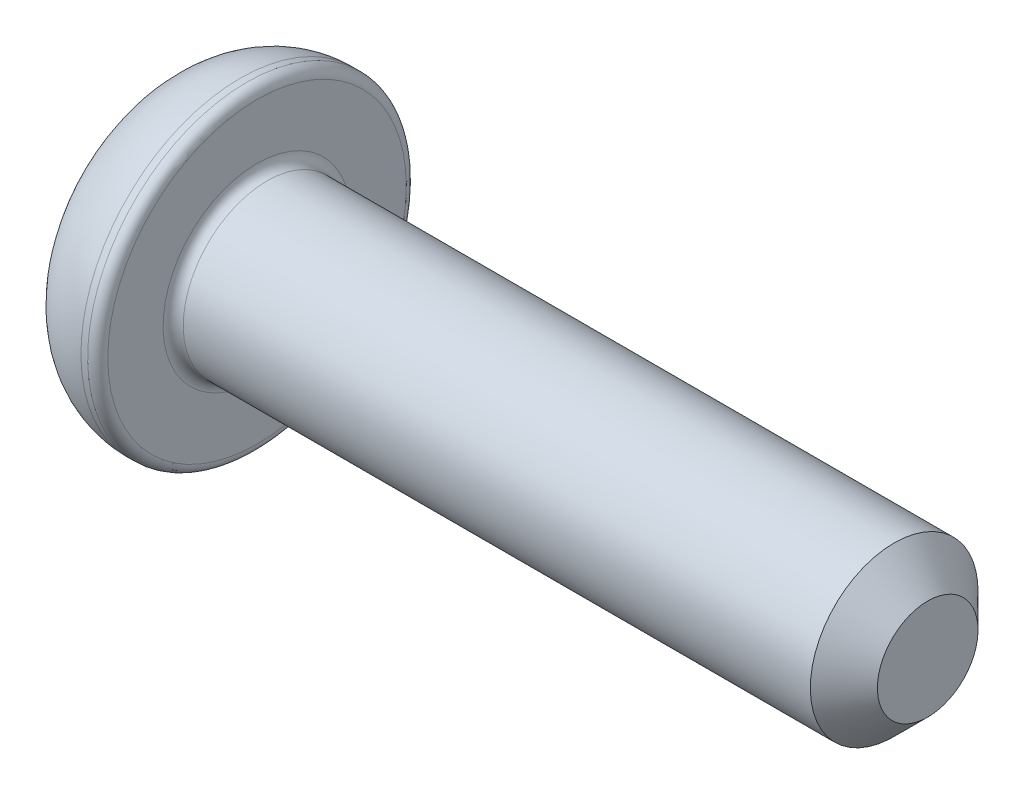
ISO-10303-21;
HEADER;
FILE_DESCRIPTION(('STEP AP214'),'2;1');
FILE_NAME('part.step','',(''),(''),'','','');
FILE_SCHEMA(('AUTOMOTIVE_DESIGN { 1 0 10303 214 1 1 1 1 }'));
ENDSEC;
DATA;
#1=APPLICATION_CONTEXT('core data for automotive mechanical design processes');
#2=APPLICATION_PROTOCOL_DEFINITION('international standard','automotive_design',2000,#1);
#3=PRODUCT_CONTEXT('',#1,'mechanical');
#4=PRODUCT('Part','Part','',(#3));
#5=PRODUCT_RELATED_PRODUCT_CATEGORY('part','',(#4));
#6=PRODUCT_DEFINITION_FORMATION('','',#4);
#7=PRODUCT_DEFINITION_CONTEXT('part definition',#1,'design');
#8=PRODUCT_DEFINITION('design','',#6,#7);
#9=PRODUCT_DEFINITION_SHAPE('','',#8);
#10=(LENGTH_UNIT() NAMED_UNIT(*) SI_UNIT(.MILLI.,.METRE.));
#11=(NAMED_UNIT(*) PLANE_ANGLE_UNIT() SI_UNIT($,.RADIAN.));
#12=(NAMED_UNIT(*) SI_UNIT($,.STERADIAN.) SOLID_ANGLE_UNIT());
#13=UNCERTAINTY_MEASURE_WITH_UNIT(LENGTH_MEASURE(1.E-05),#10,'distance_accuracy_value','');
#14=(GEOMETRIC_REPRESENTATION_CONTEXT(3) GLOBAL_UNCERTAINTY_ASSIGNED_CONTEXT((#13)) GLOBAL_UNIT_ASSIGNED_CONTEXT((#10,
#11,#12)) REPRESENTATION_CONTEXT('',''));
#15=CARTESIAN_POINT('',(0.,0.,0.));
#16=DIRECTION('',(0.,0.,1.));
#17=DIRECTION('',(1.,0.,0.));
#18=AXIS2_PLACEMENT_3D('',#15,#16,#17);
#19=CARTESIAN_POINT('',(0.,0.,0.));
#20=DIRECTION('',(-1.,0.,0.));
#21=DIRECTION('',(0.,-1.,0.));
#22=AXIS2_PLACEMENT_3D('',#19,#20,#21);
#23=PLANE('',#22);
#24=DIRECTION('',(0.,0.866025403784438,-0.5));
#25=VECTOR('',#24,1.);
#26=CARTESIAN_POINT('',(0.,0.,1.73205080756888));
#27=LINE('',#26,#25);
#28=CARTESIAN_POINT('',(0.,0.,1.73205080756888));
#29=VERTEX_POINT('',#28);
#30=CARTESIAN_POINT('',(0.,1.5,0.866025403784438));
#31=VERTEX_POINT('',#30);
#32=EDGE_CURVE('E55',#29,#31,#27,.T.);
#33=ORIENTED_EDGE('',*,*,#32,.F.);
#34=DIRECTION('',(0.,0.866025403784439,0.5));
#35=VECTOR('',#34,1.);
#36=CARTESIAN_POINT('',(0.,-1.5,0.866025403784438));
#37=LINE('',#36,#35);
#38=CARTESIAN_POINT('',(0.,-1.5,0.866025403784438));
#39=VERTEX_POINT('',#38);
#40=EDGE_CURVE('E138',#39,#29,#37,.T.);
#41=ORIENTED_EDGE('',*,*,#40,.F.);
#42=DIRECTION('',(0.,0.,1.));
#43=VECTOR('',#42,1.);
#44=CARTESIAN_POINT('',(0.,-1.5,-0.866025403784439));
#45=LINE('',#44,#43);
#46=CARTESIAN_POINT('',(0.,-1.5,-0.866025403784439));
#47=VERTEX_POINT('',#46);
#48=EDGE_CURVE('E136',#47,#39,#45,.T.);
#49=ORIENTED_EDGE('',*,*,#48,.F.);
#50=DIRECTION('',(0.,-0.866025403784438,0.5));
#51=VECTOR('',#50,1.);
#52=CARTESIAN_POINT('',(0.,0.,-1.73205080756888));
#53=LINE('',#52,#51);
#54=CARTESIAN_POINT('',(0.,0.,-1.73205080756888));
#55=VERTEX_POINT('',#54);
#56=EDGE_CURVE('E103',#55,#47,#53,.T.);
#57=ORIENTED_EDGE('',*,*,#56,.F.);
#58=DIRECTION('',(0.,-0.866025403784439,-0.5));
#59=VECTOR('',#58,1.);
#60=CARTESIAN_POINT('',(0.,1.5,-0.866025403784439));
#61=LINE('',#60,#59);
#62=CARTESIAN_POINT('',(0.,1.5,-0.866025403784439));
#63=VERTEX_POINT('',#62);
#64=EDGE_CURVE('E132',#63,#55,#61,.T.);
#65=ORIENTED_EDGE('',*,*,#64,.F.);
#66=DIRECTION('',(0.,0.,-1.));
#67=VECTOR('',#66,1.);
#68=CARTESIAN_POINT('',(0.,1.5,0.866025403784438));
#69=LINE('',#68,#67);
#70=EDGE_CURVE('E129',#31,#63,#69,.T.);
#71=ORIENTED_EDGE('',*,*,#70,.F.);
#72=EDGE_LOOP('',(#33,#41,#49,#57,#65,#71));
#73=FACE_BOUND('',#72,.T.);
#74=CARTESIAN_POINT('',(0.,0.,0.));
#75=DIRECTION('',(1.,0.,0.));
#76=DIRECTION('',(0.,1.,0.));
#77=AXIS2_PLACEMENT_3D('',#74,#75,#76);
#78=CIRCLE('',#77,3.625);
#79=CARTESIAN_POINT('',(0.,3.625,0.));
#80=VERTEX_POINT('',#79);
#81=EDGE_CURVE('E150',#80,#80,#78,.T.);
#82=ORIENTED_EDGE('',*,*,#81,.F.);
#83=EDGE_LOOP('',(#82));
#84=FACE_BOUND('',#83,.T.);
#85=ADVANCED_FACE('F39',(#73,#84),#23,.T.);
#86=CARTESIAN_POINT('',(2.1,0.,0.));
#87=DIRECTION('',(1.,0.,0.));
#88=DIRECTION('',(0.,1.,0.));
#89=AXIS2_PLACEMENT_3D('',#86,#87,#88);
#90=DEGENERATE_TOROIDAL_SURFACE('',#89,2.2275,2.5225,.T.);
#91=ORIENTED_EDGE('',*,*,#81,.T.);
#92=EDGE_LOOP('',(#91));
#93=FACE_BOUND('',#92,.T.);
#94=CARTESIAN_POINT('',(2.1,0.,0.));
#95=DIRECTION('',(1.,0.,0.));
#96=DIRECTION('',(0.,1.,0.));
#97=AXIS2_PLACEMENT_3D('',#94,#95,#96);
#98=CIRCLE('',#97,4.75);
#99=CARTESIAN_POINT('',(2.1,4.75,0.));
#100=VERTEX_POINT('',#99);
#101=EDGE_CURVE('E142',#100,#100,#98,.T.);
#102=ORIENTED_EDGE('',*,*,#101,.F.);
#103=EDGE_LOOP('',(#102));
#104=FACE_BOUND('',#103,.T.);
#105=ADVANCED_FACE('F179',(#93,#104),#90,.T.);
#106=CARTESIAN_POINT('',(22.6,0.,0.));
#107=DIRECTION('',(1.,0.,0.));
#108=DIRECTION('',(0.,1.,0.));
#109=AXIS2_PLACEMENT_3D('',#106,#107,#108);
#110=CYLINDRICAL_SURFACE('',#109,4.75);
#111=CARTESIAN_POINT('',(2.3,0.,0.));
#112=DIRECTION('',(1.,0.,0.));
#113=DIRECTION('',(0.,1.,0.));
#114=AXIS2_PLACEMENT_3D('',#111,#112,#113);
#115=CIRCLE('',#114,4.75);
#116=CARTESIAN_POINT('',(2.3,4.75,0.));
#117=VERTEX_POINT('',#116);
#118=EDGE_CURVE('E162',#117,#117,#115,.F.);
#119=ORIENTED_EDGE('',*,*,#118,.T.);
#120=EDGE_LOOP('',(#119));
#121=FACE_BOUND('',#120,.T.);
#122=ORIENTED_EDGE('',*,*,#101,.T.);
#123=EDGE_LOOP('',(#122));
#124=FACE_BOUND('',#123,.T.);
#125=ADVANCED_FACE('F185',(#121,#124),#110,.T.);
#126=CARTESIAN_POINT('',(2.6,4.75,0.));
#127=DIRECTION('',(1.,0.,0.));
#128=DIRECTION('',(0.,1.,0.));
#129=AXIS2_PLACEMENT_3D('',#126,#127,#128);
#130=PLANE('',#129);
#131=CARTESIAN_POINT('',(2.6,0.,0.));
#132=DIRECTION('',(1.,0.,0.));
#133=DIRECTION('',(0.,1.,0.));
#134=AXIS2_PLACEMENT_3D('',#131,#132,#133);
#135=CIRCLE('',#134,2.8);
#136=CARTESIAN_POINT('',(2.6,2.8,0.));
#137=VERTEX_POINT('',#136);
#138=EDGE_CURVE('E159',#137,#137,#135,.F.);
#139=ORIENTED_EDGE('',*,*,#138,.T.);
#140=EDGE_LOOP('',(#139));
#141=FACE_BOUND('',#140,.T.);
#142=CARTESIAN_POINT('',(2.6,0.,0.));
#143=DIRECTION('',(1.,0.,0.));
#144=DIRECTION('',(0.,1.,0.));
#145=AXIS2_PLACEMENT_3D('',#142,#143,#144);
#146=CIRCLE('',#145,4.45);
#147=CARTESIAN_POINT('',(2.6,4.45,0.));
#148=VERTEX_POINT('',#147);
#149=EDGE_CURVE('E156',#148,#148,#146,.T.);
#150=ORIENTED_EDGE('',*,*,#149,.T.);
#151=EDGE_LOOP('',(#150));
#152=FACE_BOUND('',#151,.T.);
#153=ADVANCED_FACE('F204',(#141,#152),#130,.T.);
#154=CARTESIAN_POINT('',(22.6,0.,0.));
#155=DIRECTION('',(1.,0.,0.));
#156=DIRECTION('',(0.,1.,0.));
#157=AXIS2_PLACEMENT_3D('',#154,#155,#156);
#158=CYLINDRICAL_SURFACE('',#157,2.5);
#159=CARTESIAN_POINT('',(21.6,0.,0.));
#160=DIRECTION('',(1.,0.,0.));
#161=DIRECTION('',(0.,1.,0.));
#162=AXIS2_PLACEMENT_3D('',#159,#160,#161);
#163=CIRCLE('',#162,2.5);
#164=CARTESIAN_POINT('',(21.6,2.5,0.));
#165=VERTEX_POINT('',#164);
#166=EDGE_CURVE('E11',#165,#165,#163,.F.);
#167=ORIENTED_EDGE('',*,*,#166,.T.);
#168=EDGE_LOOP('',(#167));
#169=FACE_BOUND('',#168,.T.);
#170=CARTESIAN_POINT('',(2.9,0.,0.));
#171=DIRECTION('',(1.,0.,0.));
#172=DIRECTION('',(0.,1.,0.));
#173=AXIS2_PLACEMENT_3D('',#170,#171,#172);
#174=CIRCLE('',#173,2.5);
#175=CARTESIAN_POINT('',(2.9,2.5,0.));
#176=VERTEX_POINT('',#175);
#177=EDGE_CURVE('E153',#176,#176,#174,.T.);
#178=ORIENTED_EDGE('',*,*,#177,.T.);
#179=EDGE_LOOP('',(#178));
#180=FACE_BOUND('',#179,.T.);
#181=ADVANCED_FACE('F202',(#169,#180),#158,.T.);
#182=CARTESIAN_POINT('',(22.6,2.5,0.));
#183=DIRECTION('',(1.,0.,0.));
#184=DIRECTION('',(0.,1.,0.));
#185=AXIS2_PLACEMENT_3D('',#182,#183,#184);
#186=PLANE('',#185);
#187=CARTESIAN_POINT('',(22.6,0.,0.));
#188=DIRECTION('',(1.,0.,0.));
#189=DIRECTION('',(0.,1.,0.));
#190=AXIS2_PLACEMENT_3D('',#187,#188,#189);
#191=CIRCLE('',#190,1.49999999999999);
#192=CARTESIAN_POINT('',(22.6,1.49999999999999,0.));
#193=VERTEX_POINT('',#192);
#194=EDGE_CURVE('E48',#193,#193,#191,.T.);
#195=ORIENTED_EDGE('',*,*,#194,.T.);
#196=EDGE_LOOP('',(#195));
#197=FACE_BOUND('',#196,.T.);
#198=ADVANCED_FACE('F167',(#197),#186,.T.);
#199=CARTESIAN_POINT('',(1.5,0.,1.73205080756888));
#200=DIRECTION('',(0.,0.5,0.866025403784439));
#201=DIRECTION('',(0.,-0.866025403784439,0.5));
#202=AXIS2_PLACEMENT_3D('',#199,#200,#201);
#203=PLANE('',#202);
#204=ORIENTED_EDGE('',*,*,#32,.T.);
#205=DIRECTION('',(-1.,0.,0.));
#206=VECTOR('',#205,1.);
#207=CARTESIAN_POINT('',(1.5,1.5,0.866025403784438));
#208=LINE('',#207,#206);
#209=CARTESIAN_POINT('',(1.5,1.5,0.866025403784438));
#210=VERTEX_POINT('',#209);
#211=EDGE_CURVE('E85',#210,#31,#208,.T.);
#212=ORIENTED_EDGE('',*,*,#211,.F.);
#213=DIRECTION('',(0.,0.866025403784438,-0.5));
#214=VECTOR('',#213,1.);
#215=CARTESIAN_POINT('',(1.5,0.,1.73205080756888));
#216=LINE('',#215,#214);
#217=CARTESIAN_POINT('',(1.5,0.,1.73205080756888));
#218=VERTEX_POINT('',#217);
#219=EDGE_CURVE('E140',#218,#210,#216,.T.);
#220=ORIENTED_EDGE('',*,*,#219,.F.);
#221=DIRECTION('',(-1.,0.,0.));
#222=VECTOR('',#221,1.);
#223=CARTESIAN_POINT('',(1.5,0.,1.73205080756888));
#224=LINE('',#223,#222);
#225=EDGE_CURVE('E63',#218,#29,#224,.T.);
#226=ORIENTED_EDGE('',*,*,#225,.T.);
#227=EDGE_LOOP('',(#204,#212,#220,#226));
#228=FACE_BOUND('',#227,.T.);
#229=ADVANCED_FACE('F211',(#228),#203,.F.);
#230=CARTESIAN_POINT('',(1.5,-1.5,0.866025403784438));
#231=DIRECTION('',(0.,-0.5,0.866025403784438));
#232=DIRECTION('',(0.,-0.866025403784439,-0.5));
#233=AXIS2_PLACEMENT_3D('',#230,#231,#232);
#234=PLANE('',#233);
#235=ORIENTED_EDGE('',*,*,#40,.T.);
#236=ORIENTED_EDGE('',*,*,#225,.F.);
#237=DIRECTION('',(0.,0.866025403784439,0.5));
#238=VECTOR('',#237,1.);
#239=CARTESIAN_POINT('',(1.5,-1.5,0.866025403784438));
#240=LINE('',#239,#238);
#241=CARTESIAN_POINT('',(1.5,-1.5,0.866025403784438));
#242=VERTEX_POINT('',#241);
#243=EDGE_CURVE('E115',#242,#218,#240,.T.);
#244=ORIENTED_EDGE('',*,*,#243,.F.);
#245=DIRECTION('',(-1.,0.,0.));
#246=VECTOR('',#245,1.);
#247=CARTESIAN_POINT('',(1.5,-1.5,0.866025403784438));
#248=LINE('',#247,#246);
#249=EDGE_CURVE('E107',#242,#39,#248,.T.);
#250=ORIENTED_EDGE('',*,*,#249,.T.);
#251=EDGE_LOOP('',(#235,#236,#244,#250));
#252=FACE_BOUND('',#251,.T.);
#253=ADVANCED_FACE('F270',(#252),#234,.F.);
#254=CARTESIAN_POINT('',(1.5,-1.5,-0.866025403784439));
#255=DIRECTION('',(0.,-1.,0.));
#256=DIRECTION('',(0.,0.,-1.));
#257=AXIS2_PLACEMENT_3D('',#254,#255,#256);
#258=PLANE('',#257);
#259=ORIENTED_EDGE('',*,*,#48,.T.);
#260=ORIENTED_EDGE('',*,*,#249,.F.);
#261=DIRECTION('',(0.,0.,1.));
#262=VECTOR('',#261,1.);
#263=CARTESIAN_POINT('',(1.5,-1.5,-0.866025403784439));
#264=LINE('',#263,#262);
#265=CARTESIAN_POINT('',(1.5,-1.5,-0.866025403784439));
#266=VERTEX_POINT('',#265);
#267=EDGE_CURVE('E111',#266,#242,#264,.T.);
#268=ORIENTED_EDGE('',*,*,#267,.F.);
#269=DIRECTION('',(-1.,0.,0.));
#270=VECTOR('',#269,1.);
#271=CARTESIAN_POINT('',(1.5,-1.5,-0.866025403784439));
#272=LINE('',#271,#270);
#273=EDGE_CURVE('E96',#266,#47,#272,.T.);
#274=ORIENTED_EDGE('',*,*,#273,.T.);
#275=EDGE_LOOP('',(#259,#260,#268,#274));
#276=FACE_BOUND('',#275,.T.);
#277=ADVANCED_FACE('F112',(#276),#258,.F.);
#278=CARTESIAN_POINT('',(1.5,0.,-1.73205080756888));
#279=DIRECTION('',(0.,-0.5,-0.866025403784439));
#280=DIRECTION('',(0.,0.866025403784439,-0.5));
#281=AXIS2_PLACEMENT_3D('',#278,#279,#280);
#282=PLANE('',#281);
#283=ORIENTED_EDGE('',*,*,#56,.T.);
#284=ORIENTED_EDGE('',*,*,#273,.F.);
#285=DIRECTION('',(0.,-0.866025403784438,0.5));
#286=VECTOR('',#285,1.);
#287=CARTESIAN_POINT('',(1.5,0.,-1.73205080756888));
#288=LINE('',#287,#286);
#289=CARTESIAN_POINT('',(1.5,0.,-1.73205080756888));
#290=VERTEX_POINT('',#289);
#291=EDGE_CURVE('E100',#290,#266,#288,.T.);
#292=ORIENTED_EDGE('',*,*,#291,.F.);
#293=DIRECTION('',(-1.,0.,0.));
#294=VECTOR('',#293,1.);
#295=CARTESIAN_POINT('',(1.5,0.,-1.73205080756888));
#296=LINE('',#295,#294);
#297=EDGE_CURVE('E108',#290,#55,#296,.T.);
#298=ORIENTED_EDGE('',*,*,#297,.T.);
#299=EDGE_LOOP('',(#283,#284,#292,#298));
#300=FACE_BOUND('',#299,.T.);
#301=ADVANCED_FACE('F98',(#300),#282,.F.);
#302=CARTESIAN_POINT('',(1.5,1.5,-0.866025403784439));
#303=DIRECTION('',(0.,0.5,-0.866025403784439));
#304=DIRECTION('',(0.,0.866025403784439,0.5));
#305=AXIS2_PLACEMENT_3D('',#302,#303,#304);
#306=PLANE('',#305);
#307=ORIENTED_EDGE('',*,*,#64,.T.);
#308=ORIENTED_EDGE('',*,*,#297,.F.);
#309=DIRECTION('',(0.,-0.866025403784439,-0.5));
#310=VECTOR('',#309,1.);
#311=CARTESIAN_POINT('',(1.5,1.5,-0.866025403784439));
#312=LINE('',#311,#310);
#313=CARTESIAN_POINT('',(1.5,1.5,-0.866025403784439));
#314=VERTEX_POINT('',#313);
#315=EDGE_CURVE('E121',#314,#290,#312,.T.);
#316=ORIENTED_EDGE('',*,*,#315,.F.);
#317=DIRECTION('',(-1.,0.,0.));
#318=VECTOR('',#317,1.);
#319=CARTESIAN_POINT('',(1.5,1.5,-0.866025403784439));
#320=LINE('',#319,#318);
#321=EDGE_CURVE('E145',#314,#63,#320,.T.);
#322=ORIENTED_EDGE('',*,*,#321,.T.);
#323=EDGE_LOOP('',(#307,#308,#316,#322));
#324=FACE_BOUND('',#323,.T.);
#325=ADVANCED_FACE('F287',(#324),#306,.F.);
#326=CARTESIAN_POINT('',(1.5,1.5,0.866025403784438));
#327=DIRECTION('',(0.,1.,0.));
#328=DIRECTION('',(0.,0.,1.));
#329=AXIS2_PLACEMENT_3D('',#326,#327,#328);
#330=PLANE('',#329);
#331=ORIENTED_EDGE('',*,*,#70,.T.);
#332=ORIENTED_EDGE('',*,*,#321,.F.);
#333=DIRECTION('',(0.,0.,-1.));
#334=VECTOR('',#333,1.);
#335=CARTESIAN_POINT('',(1.5,1.5,0.866025403784438));
#336=LINE('',#335,#334);
#337=EDGE_CURVE('E123',#210,#314,#336,.T.);
#338=ORIENTED_EDGE('',*,*,#337,.F.);
#339=ORIENTED_EDGE('',*,*,#211,.T.);
#340=EDGE_LOOP('',(#331,#332,#338,#339));
#341=FACE_BOUND('',#340,.T.);
#342=ADVANCED_FACE('F196',(#341),#330,.F.);
#343=CARTESIAN_POINT('',(1.5,0.,0.));
#344=DIRECTION('',(-1.,0.,0.));
#345=DIRECTION('',(0.,0.,1.));
#346=AXIS2_PLACEMENT_3D('',#343,#344,#345);
#347=PLANE('',#346);
#348=ORIENTED_EDGE('',*,*,#219,.T.);
#349=ORIENTED_EDGE('',*,*,#337,.T.);
#350=ORIENTED_EDGE('',*,*,#315,.T.);
#351=ORIENTED_EDGE('',*,*,#291,.T.);
#352=ORIENTED_EDGE('',*,*,#267,.T.);
#353=ORIENTED_EDGE('',*,*,#243,.T.);
#354=EDGE_LOOP('',(#348,#349,#350,#351,#352,#353));
#355=FACE_BOUND('',#354,.T.);
#356=ADVANCED_FACE('F118',(#355),#347,.T.);
#357=CARTESIAN_POINT('',(2.9,0.,0.));
#358=DIRECTION('',(1.,0.,0.));
#359=DIRECTION('',(0.,1.,0.));
#360=AXIS2_PLACEMENT_3D('',#357,#358,#359);
#361=TOROIDAL_SURFACE('',#360,2.8,0.3);
#362=ORIENTED_EDGE('',*,*,#138,.F.);
#363=EDGE_LOOP('',(#362));
#364=FACE_BOUND('',#363,.T.);
#365=ORIENTED_EDGE('',*,*,#177,.F.);
#366=EDGE_LOOP('',(#365));
#367=FACE_BOUND('',#366,.T.);
#368=ADVANCED_FACE('F175',(#364,#367),#361,.F.);
#369=CARTESIAN_POINT('',(2.3,0.,0.));
#370=DIRECTION('',(1.,0.,0.));
#371=DIRECTION('',(0.,1.,0.));
#372=AXIS2_PLACEMENT_3D('',#369,#370,#371);
#373=TOROIDAL_SURFACE('',#372,4.45,0.3);
#374=ORIENTED_EDGE('',*,*,#118,.F.);
#375=EDGE_LOOP('',(#374));
#376=FACE_BOUND('',#375,.T.);
#377=ORIENTED_EDGE('',*,*,#149,.F.);
#378=EDGE_LOOP('',(#377));
#379=FACE_BOUND('',#378,.T.);
#380=ADVANCED_FACE('F170',(#376,#379),#373,.T.);
#381=CARTESIAN_POINT('',(22.6,0.,0.));
#382=DIRECTION('',(-1.,0.,0.));
#383=DIRECTION('',(0.,-1.,0.));
#384=AXIS2_PLACEMENT_3D('',#381,#382,#383);
#385=CONICAL_SURFACE('',#384,1.49999999999999,0.785398163397447);
#386=ORIENTED_EDGE('',*,*,#166,.F.);
#387=EDGE_LOOP('',(#386));
#388=FACE_BOUND('',#387,.T.);
#389=ORIENTED_EDGE('',*,*,#194,.F.);
#390=EDGE_LOOP('',(#389));
#391=FACE_BOUND('',#390,.T.);
#392=ADVANCED_FACE('F42',(#388,#391),#385,.T.);
#393=CLOSED_SHELL('',(#85,#105,#125,#153,#181,#198,#229,#253,#277,#301,#325,#342,#356,#368,#380,#392));
#394=MANIFOLD_SOLID_BREP('B2',#393);
#395=ADVANCED_BREP_SHAPE_REPRESENTATION('',(#18,#394),#14);
#396=SHAPE_DEFINITION_REPRESENTATION(#9,#395);
ENDSEC;
END-ISO-10303-21;
